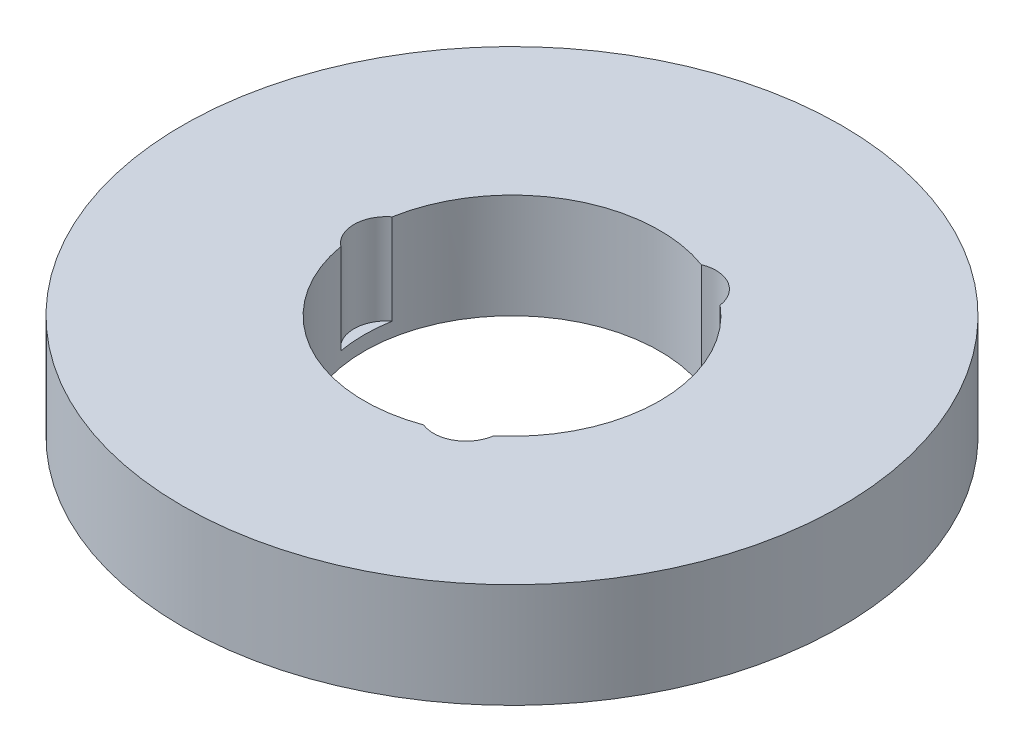
ISO-10303-21;
HEADER;
FILE_DESCRIPTION(('STEP AP214'),'2;1');
FILE_NAME('part.step','',(''),(''),'','','');
FILE_SCHEMA(('AUTOMOTIVE_DESIGN { 1 0 10303 214 1 1 1 1 }'));
ENDSEC;
DATA;
#1=APPLICATION_CONTEXT('core data for automotive mechanical design processes');
#2=APPLICATION_PROTOCOL_DEFINITION('international standard','automotive_design',2000,#1);
#3=PRODUCT_CONTEXT('',#1,'mechanical');
#4=PRODUCT('Part','Part','',(#3));
#5=PRODUCT_RELATED_PRODUCT_CATEGORY('part','',(#4));
#6=PRODUCT_DEFINITION_FORMATION('','',#4);
#7=PRODUCT_DEFINITION_CONTEXT('part definition',#1,'design');
#8=PRODUCT_DEFINITION('design','',#6,#7);
#9=PRODUCT_DEFINITION_SHAPE('','',#8);
#10=(LENGTH_UNIT() NAMED_UNIT(*) SI_UNIT(.MILLI.,.METRE.));
#11=(NAMED_UNIT(*) PLANE_ANGLE_UNIT() SI_UNIT($,.RADIAN.));
#12=(NAMED_UNIT(*) SI_UNIT($,.STERADIAN.) SOLID_ANGLE_UNIT());
#13=UNCERTAINTY_MEASURE_WITH_UNIT(LENGTH_MEASURE(1.E-05),#10,'distance_accuracy_value','');
#14=(GEOMETRIC_REPRESENTATION_CONTEXT(3) GLOBAL_UNCERTAINTY_ASSIGNED_CONTEXT((#13)) GLOBAL_UNIT_ASSIGNED_CONTEXT((#10,
#11,#12)) REPRESENTATION_CONTEXT('',''));
#15=CARTESIAN_POINT('',(0.,0.,0.));
#16=DIRECTION('',(0.,0.,1.));
#17=DIRECTION('',(1.,0.,0.));
#18=AXIS2_PLACEMENT_3D('',#15,#16,#17);
#19=CARTESIAN_POINT('',(0.,23.,0.));
#20=DIRECTION('',(0.,-1.,0.));
#21=DIRECTION('',(0.,0.,-1.));
#22=AXIS2_PLACEMENT_3D('',#19,#20,#21);
#23=CYLINDRICAL_SURFACE('',#22,72.5);
#24=CARTESIAN_POINT('',(0.,23.,0.));
#25=DIRECTION('',(0.,1.,0.));
#26=DIRECTION('',(0.,0.,1.));
#27=AXIS2_PLACEMENT_3D('',#24,#25,#26);
#28=CIRCLE('',#27,72.5);
#29=CARTESIAN_POINT('',(0.,23.,72.5));
#30=VERTEX_POINT('',#29);
#31=EDGE_CURVE('E130',#30,#30,#28,.T.);
#32=ORIENTED_EDGE('',*,*,#31,.F.);
#33=EDGE_LOOP('',(#32));
#34=FACE_BOUND('',#33,.T.);
#35=CARTESIAN_POINT('',(0.,0.,0.));
#36=DIRECTION('',(0.,1.,0.));
#37=DIRECTION('',(0.,0.,1.));
#38=AXIS2_PLACEMENT_3D('',#35,#36,#37);
#39=CIRCLE('',#38,72.5);
#40=CARTESIAN_POINT('',(0.,0.,72.5));
#41=VERTEX_POINT('',#40);
#42=EDGE_CURVE('E117',#41,#41,#39,.T.);
#43=ORIENTED_EDGE('',*,*,#42,.T.);
#44=EDGE_LOOP('',(#43));
#45=FACE_BOUND('',#44,.T.);
#46=ADVANCED_FACE('F39',(#34,#45),#23,.T.);
#47=CARTESIAN_POINT('',(0.,23.,0.));
#48=DIRECTION('',(0.,1.,0.));
#49=DIRECTION('',(0.,0.,1.));
#50=AXIS2_PLACEMENT_3D('',#47,#48,#49);
#51=PLANE('',#50);
#52=CARTESIAN_POINT('',(13.8025719365941,23.,23.9067558693051));
#53=DIRECTION('',(0.,1.,0.));
#54=DIRECTION('',(0.866025403784436,0.,-0.500000000000004));
#55=AXIS2_PLACEMENT_3D('',#52,#53,#54);
#56=CIRCLE('',#55,7.16016363649032);
#57=CARTESIAN_POINT('',(11.1109169473387,23.,30.5417341450898));
#58=VERTEX_POINT('',#57);
#59=CARTESIAN_POINT('',(20.8944591716092,23.,24.893203408279));
#60=VERTEX_POINT('',#59);
#61=EDGE_CURVE('E148',#58,#60,#56,.T.);
#62=ORIENTED_EDGE('',*,*,#61,.F.);
#63=CARTESIAN_POINT('',(0.,23.,0.));
#64=DIRECTION('',(0.,1.,0.));
#65=DIRECTION('',(0.,0.,1.));
#66=AXIS2_PLACEMENT_3D('',#63,#64,#65);
#67=CIRCLE('',#66,32.5);
#68=CARTESIAN_POINT('',(-32.0053761189477,23.,5.64853073681069));
#69=VERTEX_POINT('',#68);
#70=EDGE_CURVE('E113',#69,#58,#67,.T.);
#71=ORIENTED_EDGE('',*,*,#70,.F.);
#72=CARTESIAN_POINT('',(-27.605143873188,23.,0.));
#73=DIRECTION('',(0.,1.,0.));
#74=DIRECTION('',(0.,0.,1.));
#75=AXIS2_PLACEMENT_3D('',#72,#73,#74);
#76=CIRCLE('',#75,7.16016363649032);
#77=CARTESIAN_POINT('',(-32.0053761189477,23.,-5.64853073681069));
#78=VERTEX_POINT('',#77);
#79=EDGE_CURVE('E125',#78,#69,#76,.T.);
#80=ORIENTED_EDGE('',*,*,#79,.F.);
#81=CARTESIAN_POINT('',(11.1109169473383,23.,-30.5417341450899));
#82=VERTEX_POINT('',#81);
#83=EDGE_CURVE('E107',#82,#78,#67,.T.);
#84=ORIENTED_EDGE('',*,*,#83,.F.);
#85=CARTESIAN_POINT('',(13.8025719365938,23.,-23.9067558693053));
#86=DIRECTION('',(0.,1.,0.));
#87=DIRECTION('',(-0.866025403784443,0.,-0.499999999999992));
#88=AXIS2_PLACEMENT_3D('',#85,#86,#87);
#89=CIRCLE('',#88,7.16016363649032);
#90=CARTESIAN_POINT('',(20.8944591716089,23.,-24.8932034082793));
#91=VERTEX_POINT('',#90);
#92=EDGE_CURVE('E95',#91,#82,#89,.T.);
#93=ORIENTED_EDGE('',*,*,#92,.F.);
#94=EDGE_CURVE('E106',#60,#91,#67,.T.);
#95=ORIENTED_EDGE('',*,*,#94,.F.);
#96=EDGE_LOOP('',(#62,#71,#80,#84,#93,#95));
#97=FACE_BOUND('',#96,.T.);
#98=ORIENTED_EDGE('',*,*,#31,.T.);
#99=EDGE_LOOP('',(#98));
#100=FACE_BOUND('',#99,.T.);
#101=ADVANCED_FACE('F102',(#97,#100),#51,.T.);
#102=CARTESIAN_POINT('',(0.,0.,0.));
#103=DIRECTION('',(0.,1.,0.));
#104=DIRECTION('',(0.,0.,1.));
#105=AXIS2_PLACEMENT_3D('',#102,#103,#104);
#106=PLANE('',#105);
#107=CARTESIAN_POINT('',(0.,0.,0.));
#108=DIRECTION('',(0.,1.,0.));
#109=DIRECTION('',(0.,0.,1.));
#110=AXIS2_PLACEMENT_3D('',#107,#108,#109);
#111=CIRCLE('',#110,32.5);
#112=CARTESIAN_POINT('',(0.,0.,32.5));
#113=VERTEX_POINT('',#112);
#114=EDGE_CURVE('E118',#113,#113,#111,.T.);
#115=ORIENTED_EDGE('',*,*,#114,.T.);
#116=EDGE_LOOP('',(#115));
#117=FACE_BOUND('',#116,.T.);
#118=ORIENTED_EDGE('',*,*,#42,.F.);
#119=EDGE_LOOP('',(#118));
#120=FACE_BOUND('',#119,.T.);
#121=ADVANCED_FACE('F161',(#117,#120),#106,.F.);
#122=CARTESIAN_POINT('',(0.,23.,0.));
#123=DIRECTION('',(0.,-1.,0.));
#124=DIRECTION('',(0.,0.,-1.));
#125=AXIS2_PLACEMENT_3D('',#122,#123,#124);
#126=CYLINDRICAL_SURFACE('',#125,32.5);
#127=DIRECTION('',(0.,1.,0.));
#128=VECTOR('',#127,1.);
#129=CARTESIAN_POINT('',(11.1109169473387,13.0601435324581,30.5417341450898));
#130=LINE('',#129,#128);
#131=CARTESIAN_POINT('',(11.1109169473387,3.12028706491626,30.5417341450898));
#132=VERTEX_POINT('',#131);
#133=EDGE_CURVE('E11',#132,#58,#130,.T.);
#134=ORIENTED_EDGE('',*,*,#133,.F.);
#135=CARTESIAN_POINT('',(0.,3.12028706491626,0.));
#136=DIRECTION('',(0.,1.,0.));
#137=DIRECTION('',(0.,0.,1.));
#138=AXIS2_PLACEMENT_3D('',#135,#136,#137);
#139=CIRCLE('',#138,32.5);
#140=CARTESIAN_POINT('',(20.8944591716092,3.12028706491626,24.893203408279));
#141=VERTEX_POINT('',#140);
#142=EDGE_CURVE('E100',#132,#141,#139,.T.);
#143=ORIENTED_EDGE('',*,*,#142,.T.);
#144=DIRECTION('',(0.,1.,0.));
#145=VECTOR('',#144,1.);
#146=CARTESIAN_POINT('',(20.8944591716092,13.0601435324581,24.893203408279));
#147=LINE('',#146,#145);
#148=EDGE_CURVE('E46',#60,#141,#147,.F.);
#149=ORIENTED_EDGE('',*,*,#148,.F.);
#150=ORIENTED_EDGE('',*,*,#94,.T.);
#151=DIRECTION('',(0.,1.,0.));
#152=VECTOR('',#151,1.);
#153=CARTESIAN_POINT('',(20.8944591716089,13.0601435324581,-24.8932034082793));
#154=LINE('',#153,#152);
#155=CARTESIAN_POINT('',(20.8944591716089,3.12028706491626,-24.8932034082793));
#156=VERTEX_POINT('',#155);
#157=EDGE_CURVE('E90',#156,#91,#154,.T.);
#158=ORIENTED_EDGE('',*,*,#157,.F.);
#159=CARTESIAN_POINT('',(0.,3.12028706491626,0.));
#160=DIRECTION('',(0.,1.,0.));
#161=DIRECTION('',(0.,0.,1.));
#162=AXIS2_PLACEMENT_3D('',#159,#160,#161);
#163=CIRCLE('',#162,32.5);
#164=CARTESIAN_POINT('',(11.1109169473383,3.12028706491626,-30.5417341450899));
#165=VERTEX_POINT('',#164);
#166=EDGE_CURVE('E143',#156,#165,#163,.T.);
#167=ORIENTED_EDGE('',*,*,#166,.T.);
#168=DIRECTION('',(0.,1.,0.));
#169=VECTOR('',#168,1.);
#170=CARTESIAN_POINT('',(11.1109169473383,13.0601435324581,-30.5417341450899));
#171=LINE('',#170,#169);
#172=EDGE_CURVE('E98',#82,#165,#171,.F.);
#173=ORIENTED_EDGE('',*,*,#172,.F.);
#174=ORIENTED_EDGE('',*,*,#83,.T.);
#175=DIRECTION('',(0.,1.,0.));
#176=VECTOR('',#175,1.);
#177=CARTESIAN_POINT('',(-32.0053761189477,13.0601435324581,-5.64853073681068));
#178=LINE('',#177,#176);
#179=CARTESIAN_POINT('',(-32.0053761189477,3.12028706491626,-5.64853073681069));
#180=VERTEX_POINT('',#179);
#181=EDGE_CURVE('E137',#180,#78,#178,.T.);
#182=ORIENTED_EDGE('',*,*,#181,.F.);
#183=CARTESIAN_POINT('',(0.,3.12028706491626,0.));
#184=DIRECTION('',(0.,1.,0.));
#185=DIRECTION('',(0.,0.,1.));
#186=AXIS2_PLACEMENT_3D('',#183,#184,#185);
#187=CIRCLE('',#186,32.5);
#188=CARTESIAN_POINT('',(-32.0053761189477,3.12028706491626,5.64853073681069));
#189=VERTEX_POINT('',#188);
#190=EDGE_CURVE('E128',#180,#189,#187,.T.);
#191=ORIENTED_EDGE('',*,*,#190,.T.);
#192=DIRECTION('',(0.,1.,0.));
#193=VECTOR('',#192,1.);
#194=CARTESIAN_POINT('',(-32.0053761189477,13.0601435324581,5.64853073681068));
#195=LINE('',#194,#193);
#196=EDGE_CURVE('E134',#69,#189,#195,.F.);
#197=ORIENTED_EDGE('',*,*,#196,.F.);
#198=ORIENTED_EDGE('',*,*,#70,.T.);
#199=EDGE_LOOP('',(#134,#143,#149,#150,#158,#167,#173,#174,#182,#191,#197,#198));
#200=FACE_BOUND('',#199,.T.);
#201=ORIENTED_EDGE('',*,*,#114,.F.);
#202=EDGE_LOOP('',(#201));
#203=FACE_BOUND('',#202,.T.);
#204=ADVANCED_FACE('F115',(#200,#203),#126,.F.);
#205=CARTESIAN_POINT('',(-27.605143873188,3.12028706491626,0.));
#206=DIRECTION('',(0.,1.,0.));
#207=DIRECTION('',(0.,0.,1.));
#208=AXIS2_PLACEMENT_3D('',#205,#206,#207);
#209=CYLINDRICAL_SURFACE('',#208,7.16016363649032);
#210=ORIENTED_EDGE('',*,*,#181,.T.);
#211=ORIENTED_EDGE('',*,*,#79,.T.);
#212=ORIENTED_EDGE('',*,*,#196,.T.);
#213=CARTESIAN_POINT('',(-27.605143873188,3.12028706491626,0.));
#214=DIRECTION('',(0.,1.,0.));
#215=DIRECTION('',(0.,0.,1.));
#216=AXIS2_PLACEMENT_3D('',#213,#214,#215);
#217=CIRCLE('',#216,7.16016363649032);
#218=EDGE_CURVE('E127',#180,#189,#217,.T.);
#219=ORIENTED_EDGE('',*,*,#218,.F.);
#220=EDGE_LOOP('',(#210,#211,#212,#219));
#221=FACE_BOUND('',#220,.T.);
#222=ADVANCED_FACE('F175',(#221),#209,.F.);
#223=CARTESIAN_POINT('',(-27.605143873188,3.12028706491626,0.));
#224=DIRECTION('',(0.,1.,0.));
#225=DIRECTION('',(0.,0.,1.));
#226=AXIS2_PLACEMENT_3D('',#223,#224,#225);
#227=PLANE('',#226);
#228=ORIENTED_EDGE('',*,*,#218,.T.);
#229=ORIENTED_EDGE('',*,*,#190,.F.);
#230=EDGE_LOOP('',(#228,#229));
#231=FACE_BOUND('',#230,.T.);
#232=ADVANCED_FACE('F176',(#231),#227,.T.);
#233=CARTESIAN_POINT('',(13.8025719365938,3.12028706491626,-23.9067558693053));
#234=DIRECTION('',(0.,1.,0.));
#235=DIRECTION('',(0.,0.,1.));
#236=AXIS2_PLACEMENT_3D('',#233,#234,#235);
#237=CYLINDRICAL_SURFACE('',#236,7.16016363649032);
#238=ORIENTED_EDGE('',*,*,#157,.T.);
#239=ORIENTED_EDGE('',*,*,#92,.T.);
#240=ORIENTED_EDGE('',*,*,#172,.T.);
#241=CARTESIAN_POINT('',(13.8025719365938,3.12028706491626,-23.9067558693053));
#242=DIRECTION('',(0.,1.,0.));
#243=DIRECTION('',(-0.866025403784443,0.,-0.499999999999992));
#244=AXIS2_PLACEMENT_3D('',#241,#242,#243);
#245=CIRCLE('',#244,7.16016363649032);
#246=EDGE_CURVE('E56',#156,#165,#245,.T.);
#247=ORIENTED_EDGE('',*,*,#246,.F.);
#248=EDGE_LOOP('',(#238,#239,#240,#247));
#249=FACE_BOUND('',#248,.T.);
#250=ADVANCED_FACE('F93',(#249),#237,.F.);
#251=CARTESIAN_POINT('',(13.8025719365938,3.12028706491626,-23.9067558693053));
#252=DIRECTION('',(0.,1.,0.));
#253=DIRECTION('',(-0.866025403784443,0.,-0.499999999999992));
#254=AXIS2_PLACEMENT_3D('',#251,#252,#253);
#255=PLANE('',#254);
#256=ORIENTED_EDGE('',*,*,#246,.T.);
#257=ORIENTED_EDGE('',*,*,#166,.F.);
#258=EDGE_LOOP('',(#256,#257));
#259=FACE_BOUND('',#258,.T.);
#260=ADVANCED_FACE('F153',(#259),#255,.T.);
#261=CARTESIAN_POINT('',(13.8025719365941,3.12028706491626,23.9067558693051));
#262=DIRECTION('',(0.,1.,0.));
#263=DIRECTION('',(0.,0.,1.));
#264=AXIS2_PLACEMENT_3D('',#261,#262,#263);
#265=CYLINDRICAL_SURFACE('',#264,7.16016363649032);
#266=ORIENTED_EDGE('',*,*,#133,.T.);
#267=ORIENTED_EDGE('',*,*,#61,.T.);
#268=ORIENTED_EDGE('',*,*,#148,.T.);
#269=CARTESIAN_POINT('',(13.8025719365941,3.12028706491626,23.9067558693051));
#270=DIRECTION('',(0.,1.,0.));
#271=DIRECTION('',(0.866025403784436,0.,-0.500000000000004));
#272=AXIS2_PLACEMENT_3D('',#269,#270,#271);
#273=CIRCLE('',#272,7.16016363649032);
#274=EDGE_CURVE('E55',#132,#141,#273,.T.);
#275=ORIENTED_EDGE('',*,*,#274,.F.);
#276=EDGE_LOOP('',(#266,#267,#268,#275));
#277=FACE_BOUND('',#276,.T.);
#278=ADVANCED_FACE('F144',(#277),#265,.F.);
#279=CARTESIAN_POINT('',(13.8025719365941,3.12028706491626,23.9067558693051));
#280=DIRECTION('',(0.,1.,0.));
#281=DIRECTION('',(0.866025403784436,0.,-0.500000000000004));
#282=AXIS2_PLACEMENT_3D('',#279,#280,#281);
#283=PLANE('',#282);
#284=ORIENTED_EDGE('',*,*,#274,.T.);
#285=ORIENTED_EDGE('',*,*,#142,.F.);
#286=EDGE_LOOP('',(#284,#285));
#287=FACE_BOUND('',#286,.T.);
#288=ADVANCED_FACE('F150',(#287),#283,.T.);
#289=CLOSED_SHELL('',(#46,#101,#121,#204,#222,#232,#250,#260,#278,#288));
#290=MANIFOLD_SOLID_BREP('B2',#289);
#291=ADVANCED_BREP_SHAPE_REPRESENTATION('',(#18,#290),#14);
#292=SHAPE_DEFINITION_REPRESENTATION(#9,#291);
ENDSEC;
END-ISO-10303-21;
